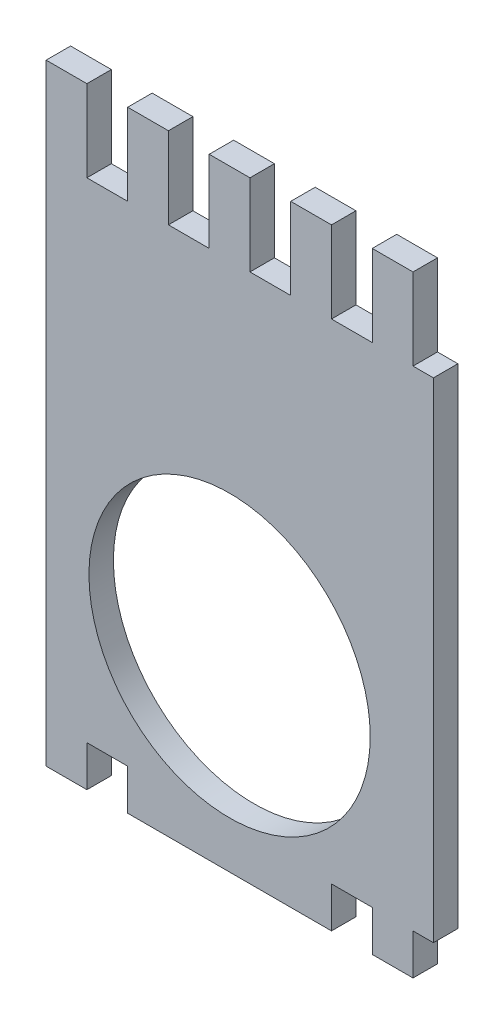
ISO-10303-21;
HEADER;
FILE_DESCRIPTION(('STEP AP214'),'2;1');
FILE_NAME('part.step','',(''),(''),'','','');
FILE_SCHEMA(('AUTOMOTIVE_DESIGN { 1 0 10303 214 1 1 1 1 }'));
ENDSEC;
DATA;
#1=APPLICATION_CONTEXT('core data for automotive mechanical design processes');
#2=APPLICATION_PROTOCOL_DEFINITION('international standard','automotive_design',2000,#1);
#3=PRODUCT_CONTEXT('',#1,'mechanical');
#4=PRODUCT('Part','Part','',(#3));
#5=PRODUCT_RELATED_PRODUCT_CATEGORY('part','',(#4));
#6=PRODUCT_DEFINITION_FORMATION('','',#4);
#7=PRODUCT_DEFINITION_CONTEXT('part definition',#1,'design');
#8=PRODUCT_DEFINITION('design','',#6,#7);
#9=PRODUCT_DEFINITION_SHAPE('','',#8);
#10=(LENGTH_UNIT() NAMED_UNIT(*) SI_UNIT(.MILLI.,.METRE.));
#11=(NAMED_UNIT(*) PLANE_ANGLE_UNIT() SI_UNIT($,.RADIAN.));
#12=(NAMED_UNIT(*) SI_UNIT($,.STERADIAN.) SOLID_ANGLE_UNIT());
#13=UNCERTAINTY_MEASURE_WITH_UNIT(LENGTH_MEASURE(1.E-05),#10,'distance_accuracy_value','');
#14=(GEOMETRIC_REPRESENTATION_CONTEXT(3) GLOBAL_UNCERTAINTY_ASSIGNED_CONTEXT((#13)) GLOBAL_UNIT_ASSIGNED_CONTEXT((#10,
#11,#12)) REPRESENTATION_CONTEXT('',''));
#15=CARTESIAN_POINT('',(0.,0.,0.));
#16=DIRECTION('',(0.,0.,1.));
#17=DIRECTION('',(1.,0.,0.));
#18=AXIS2_PLACEMENT_3D('',#15,#16,#17);
#19=CARTESIAN_POINT('',(-25.,-40.,3.));
#20=DIRECTION('',(0.,1.,0.));
#21=DIRECTION('',(0.,0.,1.));
#22=AXIS2_PLACEMENT_3D('',#19,#20,#21);
#23=PLANE('',#22);
#24=DIRECTION('',(1.,0.,0.));
#25=VECTOR('',#24,1.);
#26=CARTESIAN_POINT('',(-25.,-40.,0.));
#27=LINE('',#26,#25);
#28=CARTESIAN_POINT('',(12.5,-40.,0.));
#29=VERTEX_POINT('',#28);
#30=CARTESIAN_POINT('',(17.5,-40.,0.));
#31=VERTEX_POINT('',#30);
#32=EDGE_CURVE('E512',#29,#31,#27,.T.);
#33=ORIENTED_EDGE('',*,*,#32,.T.);
#34=DIRECTION('',(0.,0.,1.));
#35=VECTOR('',#34,1.);
#36=CARTESIAN_POINT('',(17.5,-40.,0.));
#37=LINE('',#36,#35);
#38=CARTESIAN_POINT('',(17.5,-40.,3.));
#39=VERTEX_POINT('',#38);
#40=EDGE_CURVE('E57',#31,#39,#37,.T.);
#41=ORIENTED_EDGE('',*,*,#40,.T.);
#42=DIRECTION('',(1.,0.,0.));
#43=VECTOR('',#42,1.);
#44=CARTESIAN_POINT('',(-25.,-40.,3.));
#45=LINE('',#44,#43);
#46=CARTESIAN_POINT('',(12.5,-40.,3.));
#47=VERTEX_POINT('',#46);
#48=EDGE_CURVE('E510',#47,#39,#45,.T.);
#49=ORIENTED_EDGE('',*,*,#48,.F.);
#50=DIRECTION('',(0.,0.,1.));
#51=VECTOR('',#50,1.);
#52=CARTESIAN_POINT('',(12.5,-40.,0.));
#53=LINE('',#52,#51);
#54=EDGE_CURVE('E313',#29,#47,#53,.T.);
#55=ORIENTED_EDGE('',*,*,#54,.F.);
#56=EDGE_LOOP('',(#33,#41,#49,#55));
#57=FACE_BOUND('',#56,.T.);
#58=ADVANCED_FACE('F33',(#57),#23,.F.);
#59=CARTESIAN_POINT('',(-25.,20.,3.));
#60=DIRECTION('',(0.,-1.,0.));
#61=DIRECTION('',(0.,0.,-1.));
#62=AXIS2_PLACEMENT_3D('',#59,#60,#61);
#63=PLANE('',#62);
#64=DIRECTION('',(-1.,0.,0.));
#65=VECTOR('',#64,1.);
#66=CARTESIAN_POINT('',(-25.,20.,3.));
#67=LINE('',#66,#65);
#68=CARTESIAN_POINT('',(17.5,20.,3.));
#69=VERTEX_POINT('',#68);
#70=CARTESIAN_POINT('',(12.5,20.,3.));
#71=VERTEX_POINT('',#70);
#72=EDGE_CURVE('E479',#69,#71,#67,.T.);
#73=ORIENTED_EDGE('',*,*,#72,.F.);
#74=DIRECTION('',(0.,0.,1.));
#75=VECTOR('',#74,1.);
#76=CARTESIAN_POINT('',(17.5,20.,0.));
#77=LINE('',#76,#75);
#78=CARTESIAN_POINT('',(17.5,20.,0.));
#79=VERTEX_POINT('',#78);
#80=EDGE_CURVE('E290',#79,#69,#77,.T.);
#81=ORIENTED_EDGE('',*,*,#80,.F.);
#82=DIRECTION('',(-1.,0.,0.));
#83=VECTOR('',#82,1.);
#84=CARTESIAN_POINT('',(-25.,20.,0.));
#85=LINE('',#84,#83);
#86=CARTESIAN_POINT('',(12.5,20.,0.));
#87=VERTEX_POINT('',#86);
#88=EDGE_CURVE('E458',#79,#87,#85,.T.);
#89=ORIENTED_EDGE('',*,*,#88,.T.);
#90=DIRECTION('',(0.,0.,1.));
#91=VECTOR('',#90,1.);
#92=CARTESIAN_POINT('',(12.5,20.,0.));
#93=LINE('',#92,#91);
#94=EDGE_CURVE('E342',#87,#71,#93,.T.);
#95=ORIENTED_EDGE('',*,*,#94,.T.);
#96=EDGE_LOOP('',(#73,#81,#89,#95));
#97=FACE_BOUND('',#96,.T.);
#98=ADVANCED_FACE('F524',(#97),#63,.F.);
#99=CARTESIAN_POINT('',(7.49999999999999,20.,3.));
#100=VERTEX_POINT('',#99);
#101=CARTESIAN_POINT('',(2.49999999999998,20.,3.));
#102=VERTEX_POINT('',#101);
#103=EDGE_CURVE('E471',#100,#102,#67,.T.);
#104=ORIENTED_EDGE('',*,*,#103,.F.);
#105=DIRECTION('',(0.,0.,1.));
#106=VECTOR('',#105,1.);
#107=CARTESIAN_POINT('',(7.49999999999999,20.,0.));
#108=LINE('',#107,#106);
#109=CARTESIAN_POINT('',(7.49999999999999,20.,0.));
#110=VERTEX_POINT('',#109);
#111=EDGE_CURVE('E329',#110,#100,#108,.T.);
#112=ORIENTED_EDGE('',*,*,#111,.F.);
#113=CARTESIAN_POINT('',(2.49999999999998,20.,0.));
#114=VERTEX_POINT('',#113);
#115=EDGE_CURVE('E469',#110,#114,#85,.T.);
#116=ORIENTED_EDGE('',*,*,#115,.T.);
#117=DIRECTION('',(0.,0.,1.));
#118=VECTOR('',#117,1.);
#119=CARTESIAN_POINT('',(2.49999999999998,20.,0.));
#120=LINE('',#119,#118);
#121=EDGE_CURVE('E370',#114,#102,#120,.T.);
#122=ORIENTED_EDGE('',*,*,#121,.T.);
#123=EDGE_LOOP('',(#104,#112,#116,#122));
#124=FACE_BOUND('',#123,.T.);
#125=ADVANCED_FACE('F537',(#124),#63,.F.);
#126=CARTESIAN_POINT('',(-2.50000000000001,20.,3.));
#127=VERTEX_POINT('',#126);
#128=CARTESIAN_POINT('',(-7.50000000000001,20.,3.));
#129=VERTEX_POINT('',#128);
#130=EDGE_CURVE('E470',#127,#129,#67,.T.);
#131=ORIENTED_EDGE('',*,*,#130,.F.);
#132=DIRECTION('',(0.,0.,1.));
#133=VECTOR('',#132,1.);
#134=CARTESIAN_POINT('',(-2.50000000000001,20.,0.));
#135=LINE('',#134,#133);
#136=CARTESIAN_POINT('',(-2.50000000000001,20.,0.));
#137=VERTEX_POINT('',#136);
#138=EDGE_CURVE('E357',#137,#127,#135,.T.);
#139=ORIENTED_EDGE('',*,*,#138,.F.);
#140=CARTESIAN_POINT('',(-7.50000000000001,20.,0.));
#141=VERTEX_POINT('',#140);
#142=EDGE_CURVE('E446',#137,#141,#85,.T.);
#143=ORIENTED_EDGE('',*,*,#142,.T.);
#144=DIRECTION('',(0.,0.,1.));
#145=VECTOR('',#144,1.);
#146=CARTESIAN_POINT('',(-7.50000000000002,20.,0.));
#147=LINE('',#146,#145);
#148=EDGE_CURVE('E412',#141,#129,#147,.T.);
#149=ORIENTED_EDGE('',*,*,#148,.T.);
#150=EDGE_LOOP('',(#131,#139,#143,#149));
#151=FACE_BOUND('',#150,.T.);
#152=ADVANCED_FACE('F556',(#151),#63,.F.);
#153=CARTESIAN_POINT('',(-17.5,-40.,0.));
#154=VERTEX_POINT('',#153);
#155=CARTESIAN_POINT('',(-12.5,-40.,0.));
#156=VERTEX_POINT('',#155);
#157=EDGE_CURVE('E513',#154,#156,#27,.T.);
#158=ORIENTED_EDGE('',*,*,#157,.T.);
#159=DIRECTION('',(0.,0.,1.));
#160=VECTOR('',#159,1.);
#161=CARTESIAN_POINT('',(-12.5,-40.,0.));
#162=LINE('',#161,#160);
#163=CARTESIAN_POINT('',(-12.5,-40.,3.));
#164=VERTEX_POINT('',#163);
#165=EDGE_CURVE('E385',#156,#164,#162,.T.);
#166=ORIENTED_EDGE('',*,*,#165,.T.);
#167=CARTESIAN_POINT('',(-17.5,-40.,3.));
#168=VERTEX_POINT('',#167);
#169=EDGE_CURVE('E433',#168,#164,#45,.T.);
#170=ORIENTED_EDGE('',*,*,#169,.F.);
#171=DIRECTION('',(0.,0.,1.));
#172=VECTOR('',#171,1.);
#173=CARTESIAN_POINT('',(-17.5,-40.,0.));
#174=LINE('',#173,#172);
#175=EDGE_CURVE('E429',#154,#168,#174,.T.);
#176=ORIENTED_EDGE('',*,*,#175,.F.);
#177=EDGE_LOOP('',(#158,#166,#170,#176));
#178=FACE_BOUND('',#177,.T.);
#179=ADVANCED_FACE('F634',(#178),#23,.F.);
#180=CARTESIAN_POINT('',(-12.5,20.,3.));
#181=VERTEX_POINT('',#180);
#182=CARTESIAN_POINT('',(-17.5,20.,3.));
#183=VERTEX_POINT('',#182);
#184=EDGE_CURVE('E448',#181,#183,#67,.T.);
#185=ORIENTED_EDGE('',*,*,#184,.F.);
#186=DIRECTION('',(0.,0.,1.));
#187=VECTOR('',#186,1.);
#188=CARTESIAN_POINT('',(-12.5,20.,0.));
#189=LINE('',#188,#187);
#190=CARTESIAN_POINT('',(-12.5,20.,0.));
#191=VERTEX_POINT('',#190);
#192=EDGE_CURVE('E399',#191,#181,#189,.T.);
#193=ORIENTED_EDGE('',*,*,#192,.F.);
#194=CARTESIAN_POINT('',(-17.5,20.,0.));
#195=VERTEX_POINT('',#194);
#196=EDGE_CURVE('E443',#191,#195,#85,.T.);
#197=ORIENTED_EDGE('',*,*,#196,.T.);
#198=DIRECTION('',(0.,0.,1.));
#199=VECTOR('',#198,1.);
#200=CARTESIAN_POINT('',(-17.5,20.,0.));
#201=LINE('',#200,#199);
#202=EDGE_CURVE('E491',#195,#183,#201,.T.);
#203=ORIENTED_EDGE('',*,*,#202,.T.);
#204=EDGE_LOOP('',(#185,#193,#197,#203));
#205=FACE_BOUND('',#204,.T.);
#206=ADVANCED_FACE('F570',(#205),#63,.F.);
#207=CARTESIAN_POINT('',(22.5,-40.,3.));
#208=VERTEX_POINT('',#207);
#209=CARTESIAN_POINT('',(25.,-40.,3.));
#210=VERTEX_POINT('',#209);
#211=EDGE_CURVE('E36',#208,#210,#45,.T.);
#212=ORIENTED_EDGE('',*,*,#211,.F.);
#213=DIRECTION('',(0.,0.,1.));
#214=VECTOR('',#213,1.);
#215=CARTESIAN_POINT('',(22.5,-40.,0.));
#216=LINE('',#215,#214);
#217=CARTESIAN_POINT('',(22.5,-40.,0.));
#218=VERTEX_POINT('',#217);
#219=EDGE_CURVE('E277',#218,#208,#216,.T.);
#220=ORIENTED_EDGE('',*,*,#219,.F.);
#221=CARTESIAN_POINT('',(25.,-40.,0.));
#222=VERTEX_POINT('',#221);
#223=EDGE_CURVE('E514',#218,#222,#27,.T.);
#224=ORIENTED_EDGE('',*,*,#223,.T.);
#225=DIRECTION('',(0.,0.,-1.));
#226=VECTOR('',#225,1.);
#227=CARTESIAN_POINT('',(25.,-40.,3.));
#228=LINE('',#227,#226);
#229=EDGE_CURVE('E11',#210,#222,#228,.T.);
#230=ORIENTED_EDGE('',*,*,#229,.F.);
#231=EDGE_LOOP('',(#212,#220,#224,#230));
#232=FACE_BOUND('',#231,.T.);
#233=ADVANCED_FACE('F635',(#232),#23,.F.);
#234=CARTESIAN_POINT('',(25.,20.,3.));
#235=DIRECTION('',(-1.,0.,0.));
#236=DIRECTION('',(0.,-1.,0.));
#237=AXIS2_PLACEMENT_3D('',#234,#235,#236);
#238=PLANE('',#237);
#239=DIRECTION('',(0.,1.,0.));
#240=VECTOR('',#239,1.);
#241=CARTESIAN_POINT('',(25.,20.,0.));
#242=LINE('',#241,#240);
#243=CARTESIAN_POINT('',(25.,20.,0.));
#244=VERTEX_POINT('',#243);
#245=EDGE_CURVE('E447',#222,#244,#242,.T.);
#246=ORIENTED_EDGE('',*,*,#245,.T.);
#247=DIRECTION('',(0.,0.,-1.));
#248=VECTOR('',#247,1.);
#249=CARTESIAN_POINT('',(25.,20.,3.));
#250=LINE('',#249,#248);
#251=CARTESIAN_POINT('',(25.,20.,3.));
#252=VERTEX_POINT('',#251);
#253=EDGE_CURVE('E42',#252,#244,#250,.T.);
#254=ORIENTED_EDGE('',*,*,#253,.F.);
#255=DIRECTION('',(0.,1.,0.));
#256=VECTOR('',#255,1.);
#257=CARTESIAN_POINT('',(25.,20.,3.));
#258=LINE('',#257,#256);
#259=EDGE_CURVE('E475',#210,#252,#258,.T.);
#260=ORIENTED_EDGE('',*,*,#259,.F.);
#261=ORIENTED_EDGE('',*,*,#229,.T.);
#262=EDGE_LOOP('',(#246,#254,#260,#261));
#263=FACE_BOUND('',#262,.T.);
#264=ADVANCED_FACE('F643',(#263),#238,.F.);
#265=CARTESIAN_POINT('',(22.5,20.,0.));
#266=VERTEX_POINT('',#265);
#267=EDGE_CURVE('E465',#244,#266,#85,.T.);
#268=ORIENTED_EDGE('',*,*,#267,.T.);
#269=DIRECTION('',(0.,0.,1.));
#270=VECTOR('',#269,1.);
#271=CARTESIAN_POINT('',(22.5,20.,0.));
#272=LINE('',#271,#270);
#273=CARTESIAN_POINT('',(22.5,20.,3.));
#274=VERTEX_POINT('',#273);
#275=EDGE_CURVE('E303',#266,#274,#272,.T.);
#276=ORIENTED_EDGE('',*,*,#275,.T.);
#277=EDGE_CURVE('E482',#252,#274,#67,.T.);
#278=ORIENTED_EDGE('',*,*,#277,.F.);
#279=ORIENTED_EDGE('',*,*,#253,.T.);
#280=EDGE_LOOP('',(#268,#276,#278,#279));
#281=FACE_BOUND('',#280,.T.);
#282=ADVANCED_FACE('F640',(#281),#63,.F.);
#283=CARTESIAN_POINT('',(0.,0.,3.));
#284=DIRECTION('',(0.,0.,1.));
#285=DIRECTION('',(1.,0.,0.));
#286=AXIS2_PLACEMENT_3D('',#283,#284,#285);
#287=PLANE('',#286);
#288=DIRECTION('',(0.,-1.,0.));
#289=VECTOR('',#288,1.);
#290=CARTESIAN_POINT('',(-22.5,30.,3.));
#291=LINE('',#290,#289);
#292=CARTESIAN_POINT('',(-22.5,30.,3.));
#293=VERTEX_POINT('',#292);
#294=CARTESIAN_POINT('',(-22.5,-45.,3.));
#295=VERTEX_POINT('',#294);
#296=EDGE_CURVE('E432',#293,#295,#291,.T.);
#297=ORIENTED_EDGE('',*,*,#296,.T.);
#298=DIRECTION('',(1.,0.,0.));
#299=VECTOR('',#298,1.);
#300=CARTESIAN_POINT('',(-22.5,-45.,3.));
#301=LINE('',#300,#299);
#302=CARTESIAN_POINT('',(-17.5,-45.,3.));
#303=VERTEX_POINT('',#302);
#304=EDGE_CURVE('E409',#295,#303,#301,.T.);
#305=ORIENTED_EDGE('',*,*,#304,.T.);
#306=DIRECTION('',(0.,1.,0.));
#307=VECTOR('',#306,1.);
#308=CARTESIAN_POINT('',(-17.5,-40.,3.));
#309=LINE('',#308,#307);
#310=EDGE_CURVE('E421',#303,#168,#309,.T.);
#311=ORIENTED_EDGE('',*,*,#310,.T.);
#312=ORIENTED_EDGE('',*,*,#169,.T.);
#313=DIRECTION('',(0.,-1.,0.));
#314=VECTOR('',#313,1.);
#315=CARTESIAN_POINT('',(-12.5,-40.,3.));
#316=LINE('',#315,#314);
#317=CARTESIAN_POINT('',(-12.5,-45.,3.));
#318=VERTEX_POINT('',#317);
#319=EDGE_CURVE('E367',#164,#318,#316,.T.);
#320=ORIENTED_EDGE('',*,*,#319,.T.);
#321=DIRECTION('',(1.,0.,0.));
#322=VECTOR('',#321,1.);
#323=CARTESIAN_POINT('',(-12.5,-45.,3.));
#324=LINE('',#323,#322);
#325=CARTESIAN_POINT('',(12.5,-45.,3.));
#326=VERTEX_POINT('',#325);
#327=EDGE_CURVE('E379',#318,#326,#324,.T.);
#328=ORIENTED_EDGE('',*,*,#327,.T.);
#329=DIRECTION('',(0.,1.,0.));
#330=VECTOR('',#329,1.);
#331=CARTESIAN_POINT('',(12.5,-40.,3.));
#332=LINE('',#331,#330);
#333=EDGE_CURVE('E300',#326,#47,#332,.T.);
#334=ORIENTED_EDGE('',*,*,#333,.T.);
#335=ORIENTED_EDGE('',*,*,#48,.T.);
#336=DIRECTION('',(0.,-1.,0.));
#337=VECTOR('',#336,1.);
#338=CARTESIAN_POINT('',(17.5,-40.,3.));
#339=LINE('',#338,#337);
#340=CARTESIAN_POINT('',(17.5,-45.,3.));
#341=VERTEX_POINT('',#340);
#342=EDGE_CURVE('E272',#39,#341,#339,.T.);
#343=ORIENTED_EDGE('',*,*,#342,.T.);
#344=DIRECTION('',(1.,0.,0.));
#345=VECTOR('',#344,1.);
#346=CARTESIAN_POINT('',(17.5,-45.,3.));
#347=LINE('',#346,#345);
#348=CARTESIAN_POINT('',(22.5,-45.,3.));
#349=VERTEX_POINT('',#348);
#350=EDGE_CURVE('E249',#341,#349,#347,.T.);
#351=ORIENTED_EDGE('',*,*,#350,.T.);
#352=DIRECTION('',(0.,1.,0.));
#353=VECTOR('',#352,1.);
#354=CARTESIAN_POINT('',(22.5,-40.,3.));
#355=LINE('',#354,#353);
#356=EDGE_CURVE('E266',#349,#208,#355,.T.);
#357=ORIENTED_EDGE('',*,*,#356,.T.);
#358=ORIENTED_EDGE('',*,*,#211,.T.);
#359=ORIENTED_EDGE('',*,*,#259,.T.);
#360=ORIENTED_EDGE('',*,*,#277,.T.);
#361=DIRECTION('',(0.,1.,0.));
#362=VECTOR('',#361,1.);
#363=CARTESIAN_POINT('',(22.5,30.,3.));
#364=LINE('',#363,#362);
#365=CARTESIAN_POINT('',(22.5,30.,3.));
#366=VERTEX_POINT('',#365);
#367=EDGE_CURVE('E293',#274,#366,#364,.T.);
#368=ORIENTED_EDGE('',*,*,#367,.T.);
#369=DIRECTION('',(-1.,0.,0.));
#370=VECTOR('',#369,1.);
#371=CARTESIAN_POINT('',(17.5,30.,3.));
#372=LINE('',#371,#370);
#373=CARTESIAN_POINT('',(17.5,30.,3.));
#374=VERTEX_POINT('',#373);
#375=EDGE_CURVE('E284',#366,#374,#372,.T.);
#376=ORIENTED_EDGE('',*,*,#375,.T.);
#377=DIRECTION('',(0.,-1.,0.));
#378=VECTOR('',#377,1.);
#379=CARTESIAN_POINT('',(17.5,30.,3.));
#380=LINE('',#379,#378);
#381=EDGE_CURVE('E276',#374,#69,#380,.T.);
#382=ORIENTED_EDGE('',*,*,#381,.T.);
#383=ORIENTED_EDGE('',*,*,#72,.T.);
#384=DIRECTION('',(0.,1.,0.));
#385=VECTOR('',#384,1.);
#386=CARTESIAN_POINT('',(12.5,30.,3.));
#387=LINE('',#386,#385);
#388=CARTESIAN_POINT('',(12.5,30.,3.));
#389=VERTEX_POINT('',#388);
#390=EDGE_CURVE('E332',#71,#389,#387,.T.);
#391=ORIENTED_EDGE('',*,*,#390,.T.);
#392=DIRECTION('',(-1.,0.,0.));
#393=VECTOR('',#392,1.);
#394=CARTESIAN_POINT('',(7.49999999999999,30.,3.));
#395=LINE('',#394,#393);
#396=CARTESIAN_POINT('',(7.49999999999999,30.,3.));
#397=VERTEX_POINT('',#396);
#398=EDGE_CURVE('E323',#389,#397,#395,.T.);
#399=ORIENTED_EDGE('',*,*,#398,.T.);
#400=DIRECTION('',(0.,-1.,0.));
#401=VECTOR('',#400,1.);
#402=CARTESIAN_POINT('',(7.49999999999999,30.,3.));
#403=LINE('',#402,#401);
#404=EDGE_CURVE('E316',#397,#100,#403,.T.);
#405=ORIENTED_EDGE('',*,*,#404,.T.);
#406=ORIENTED_EDGE('',*,*,#103,.T.);
#407=DIRECTION('',(0.,1.,0.));
#408=VECTOR('',#407,1.);
#409=CARTESIAN_POINT('',(2.49999999999999,30.,3.));
#410=LINE('',#409,#408);
#411=CARTESIAN_POINT('',(2.49999999999999,30.,3.));
#412=VERTEX_POINT('',#411);
#413=EDGE_CURVE('E360',#102,#412,#410,.T.);
#414=ORIENTED_EDGE('',*,*,#413,.T.);
#415=DIRECTION('',(-1.,0.,0.));
#416=VECTOR('',#415,1.);
#417=CARTESIAN_POINT('',(-2.50000000000001,30.,3.));
#418=LINE('',#417,#416);
#419=CARTESIAN_POINT('',(-2.50000000000001,30.,3.));
#420=VERTEX_POINT('',#419);
#421=EDGE_CURVE('E351',#412,#420,#418,.T.);
#422=ORIENTED_EDGE('',*,*,#421,.T.);
#423=DIRECTION('',(0.,-1.,0.));
#424=VECTOR('',#423,1.);
#425=CARTESIAN_POINT('',(-2.50000000000001,30.,3.));
#426=LINE('',#425,#424);
#427=EDGE_CURVE('E339',#420,#127,#426,.T.);
#428=ORIENTED_EDGE('',*,*,#427,.T.);
#429=ORIENTED_EDGE('',*,*,#130,.T.);
#430=DIRECTION('',(0.,1.,0.));
#431=VECTOR('',#430,1.);
#432=CARTESIAN_POINT('',(-7.50000000000001,30.,3.));
#433=LINE('',#432,#431);
#434=CARTESIAN_POINT('',(-7.50000000000001,30.,3.));
#435=VERTEX_POINT('',#434);
#436=EDGE_CURVE('E402',#129,#435,#433,.T.);
#437=ORIENTED_EDGE('',*,*,#436,.T.);
#438=DIRECTION('',(-1.,0.,0.));
#439=VECTOR('',#438,1.);
#440=CARTESIAN_POINT('',(-12.5,30.,3.));
#441=LINE('',#440,#439);
#442=CARTESIAN_POINT('',(-12.5,30.,3.));
#443=VERTEX_POINT('',#442);
#444=EDGE_CURVE('E393',#435,#443,#441,.T.);
#445=ORIENTED_EDGE('',*,*,#444,.T.);
#446=DIRECTION('',(0.,-1.,0.));
#447=VECTOR('',#446,1.);
#448=CARTESIAN_POINT('',(-12.5,30.,3.));
#449=LINE('',#448,#447);
#450=EDGE_CURVE('E387',#443,#181,#449,.T.);
#451=ORIENTED_EDGE('',*,*,#450,.T.);
#452=ORIENTED_EDGE('',*,*,#184,.T.);
#453=DIRECTION('',(0.,1.,0.));
#454=VECTOR('',#453,1.);
#455=CARTESIAN_POINT('',(-17.5,30.,3.));
#456=LINE('',#455,#454);
#457=CARTESIAN_POINT('',(-17.5,30.,3.));
#458=VERTEX_POINT('',#457);
#459=EDGE_CURVE('E485',#183,#458,#456,.T.);
#460=ORIENTED_EDGE('',*,*,#459,.T.);
#461=DIRECTION('',(-1.,0.,0.));
#462=VECTOR('',#461,1.);
#463=CARTESIAN_POINT('',(-22.5,30.,3.));
#464=LINE('',#463,#462);
#465=EDGE_CURVE('E488',#458,#293,#464,.T.);
#466=ORIENTED_EDGE('',*,*,#465,.T.);
#467=EDGE_LOOP('',(#297,#305,#311,#312,#320,#328,#334,#335,#343,#351,#357,#358,#359,#360,#368,
#376,#382,#383,#391,#399,#405,#406,#414,#422,#428,#429,#437,#445,#451,#452,#460,#466));
#468=FACE_BOUND('',#467,.T.);
#469=CARTESIAN_POINT('',(0.,-22.,3.));
#470=DIRECTION('',(0.,0.,1.));
#471=DIRECTION('',(1.,0.,0.));
#472=AXIS2_PLACEMENT_3D('',#469,#470,#471);
#473=CIRCLE('',#472,17.25);
#474=CARTESIAN_POINT('',(17.25,-22.,3.));
#475=VERTEX_POINT('',#474);
#476=EDGE_CURVE('E503',#475,#475,#473,.T.);
#477=ORIENTED_EDGE('',*,*,#476,.F.);
#478=EDGE_LOOP('',(#477));
#479=FACE_BOUND('',#478,.T.);
#480=ADVANCED_FACE('F516',(#468,#479),#287,.T.);
#481=CARTESIAN_POINT('',(0.,0.,0.));
#482=DIRECTION('',(0.,0.,1.));
#483=DIRECTION('',(1.,0.,0.));
#484=AXIS2_PLACEMENT_3D('',#481,#482,#483);
#485=PLANE('',#484);
#486=CARTESIAN_POINT('',(0.,-22.,0.));
#487=DIRECTION('',(0.,0.,1.));
#488=DIRECTION('',(1.,0.,0.));
#489=AXIS2_PLACEMENT_3D('',#486,#487,#488);
#490=CIRCLE('',#489,17.25);
#491=CARTESIAN_POINT('',(17.25,-22.,0.));
#492=VERTEX_POINT('',#491);
#493=EDGE_CURVE('E505',#492,#492,#490,.T.);
#494=ORIENTED_EDGE('',*,*,#493,.T.);
#495=EDGE_LOOP('',(#494));
#496=FACE_BOUND('',#495,.T.);
#497=DIRECTION('',(1.,0.,0.));
#498=VECTOR('',#497,1.);
#499=CARTESIAN_POINT('',(-22.5,-45.,0.));
#500=LINE('',#499,#498);
#501=CARTESIAN_POINT('',(-22.5,-45.,0.));
#502=VERTEX_POINT('',#501);
#503=CARTESIAN_POINT('',(-17.5,-45.,0.));
#504=VERTEX_POINT('',#503);
#505=EDGE_CURVE('E417',#502,#504,#500,.T.);
#506=ORIENTED_EDGE('',*,*,#505,.F.);
#507=DIRECTION('',(0.,-1.,0.));
#508=VECTOR('',#507,1.);
#509=CARTESIAN_POINT('',(-22.5,30.,0.));
#510=LINE('',#509,#508);
#511=CARTESIAN_POINT('',(-22.5,30.,0.));
#512=VERTEX_POINT('',#511);
#513=EDGE_CURVE('E602',#512,#502,#510,.T.);
#514=ORIENTED_EDGE('',*,*,#513,.F.);
#515=DIRECTION('',(-1.,0.,0.));
#516=VECTOR('',#515,1.);
#517=CARTESIAN_POINT('',(-22.5,30.,0.));
#518=LINE('',#517,#516);
#519=CARTESIAN_POINT('',(-17.5,30.,0.));
#520=VERTEX_POINT('',#519);
#521=EDGE_CURVE('E496',#520,#512,#518,.T.);
#522=ORIENTED_EDGE('',*,*,#521,.F.);
#523=DIRECTION('',(0.,1.,0.));
#524=VECTOR('',#523,1.);
#525=CARTESIAN_POINT('',(-17.5,30.,0.));
#526=LINE('',#525,#524);
#527=EDGE_CURVE('E497',#195,#520,#526,.T.);
#528=ORIENTED_EDGE('',*,*,#527,.F.);
#529=ORIENTED_EDGE('',*,*,#196,.F.);
#530=DIRECTION('',(0.,-1.,0.));
#531=VECTOR('',#530,1.);
#532=CARTESIAN_POINT('',(-12.5,30.,0.));
#533=LINE('',#532,#531);
#534=CARTESIAN_POINT('',(-12.5,30.,0.));
#535=VERTEX_POINT('',#534);
#536=EDGE_CURVE('E389',#535,#191,#533,.T.);
#537=ORIENTED_EDGE('',*,*,#536,.F.);
#538=DIRECTION('',(-1.,0.,0.));
#539=VECTOR('',#538,1.);
#540=CARTESIAN_POINT('',(-12.5,30.,0.));
#541=LINE('',#540,#539);
#542=CARTESIAN_POINT('',(-7.50000000000001,30.,0.));
#543=VERTEX_POINT('',#542);
#544=EDGE_CURVE('E396',#543,#535,#541,.T.);
#545=ORIENTED_EDGE('',*,*,#544,.F.);
#546=DIRECTION('',(0.,1.,0.));
#547=VECTOR('',#546,1.);
#548=CARTESIAN_POINT('',(-7.50000000000001,30.,0.));
#549=LINE('',#548,#547);
#550=EDGE_CURVE('E392',#141,#543,#549,.T.);
#551=ORIENTED_EDGE('',*,*,#550,.F.);
#552=ORIENTED_EDGE('',*,*,#142,.F.);
#553=DIRECTION('',(0.,-1.,0.));
#554=VECTOR('',#553,1.);
#555=CARTESIAN_POINT('',(-2.50000000000001,30.,0.));
#556=LINE('',#555,#554);
#557=CARTESIAN_POINT('',(-2.50000000000001,30.,0.));
#558=VERTEX_POINT('',#557);
#559=EDGE_CURVE('E347',#558,#137,#556,.T.);
#560=ORIENTED_EDGE('',*,*,#559,.F.);
#561=DIRECTION('',(-1.,0.,0.));
#562=VECTOR('',#561,1.);
#563=CARTESIAN_POINT('',(-2.50000000000001,30.,0.));
#564=LINE('',#563,#562);
#565=CARTESIAN_POINT('',(2.49999999999999,30.,0.));
#566=VERTEX_POINT('',#565);
#567=EDGE_CURVE('E354',#566,#558,#564,.T.);
#568=ORIENTED_EDGE('',*,*,#567,.F.);
#569=DIRECTION('',(0.,1.,0.));
#570=VECTOR('',#569,1.);
#571=CARTESIAN_POINT('',(2.49999999999999,30.,0.));
#572=LINE('',#571,#570);
#573=EDGE_CURVE('E350',#114,#566,#572,.T.);
#574=ORIENTED_EDGE('',*,*,#573,.F.);
#575=ORIENTED_EDGE('',*,*,#115,.F.);
#576=DIRECTION('',(0.,-1.,0.));
#577=VECTOR('',#576,1.);
#578=CARTESIAN_POINT('',(7.49999999999999,30.,0.));
#579=LINE('',#578,#577);
#580=CARTESIAN_POINT('',(7.49999999999999,30.,0.));
#581=VERTEX_POINT('',#580);
#582=EDGE_CURVE('E319',#581,#110,#579,.T.);
#583=ORIENTED_EDGE('',*,*,#582,.F.);
#584=DIRECTION('',(-1.,0.,0.));
#585=VECTOR('',#584,1.);
#586=CARTESIAN_POINT('',(7.49999999999999,30.,0.));
#587=LINE('',#586,#585);
#588=CARTESIAN_POINT('',(12.5,30.,0.));
#589=VERTEX_POINT('',#588);
#590=EDGE_CURVE('E326',#589,#581,#587,.T.);
#591=ORIENTED_EDGE('',*,*,#590,.F.);
#592=DIRECTION('',(0.,1.,0.));
#593=VECTOR('',#592,1.);
#594=CARTESIAN_POINT('',(12.5,30.,0.));
#595=LINE('',#594,#593);
#596=EDGE_CURVE('E322',#87,#589,#595,.T.);
#597=ORIENTED_EDGE('',*,*,#596,.F.);
#598=ORIENTED_EDGE('',*,*,#88,.F.);
#599=DIRECTION('',(0.,-1.,0.));
#600=VECTOR('',#599,1.);
#601=CARTESIAN_POINT('',(17.5,30.,0.));
#602=LINE('',#601,#600);
#603=CARTESIAN_POINT('',(17.5,30.,0.));
#604=VERTEX_POINT('',#603);
#605=EDGE_CURVE('E280',#604,#79,#602,.T.);
#606=ORIENTED_EDGE('',*,*,#605,.F.);
#607=DIRECTION('',(-1.,0.,0.));
#608=VECTOR('',#607,1.);
#609=CARTESIAN_POINT('',(17.5,30.,0.));
#610=LINE('',#609,#608);
#611=CARTESIAN_POINT('',(22.5,30.,0.));
#612=VERTEX_POINT('',#611);
#613=EDGE_CURVE('E287',#612,#604,#610,.T.);
#614=ORIENTED_EDGE('',*,*,#613,.F.);
#615=DIRECTION('',(0.,1.,0.));
#616=VECTOR('',#615,1.);
#617=CARTESIAN_POINT('',(22.5,30.,0.));
#618=LINE('',#617,#616);
#619=EDGE_CURVE('E283',#266,#612,#618,.T.);
#620=ORIENTED_EDGE('',*,*,#619,.F.);
#621=ORIENTED_EDGE('',*,*,#267,.F.);
#622=ORIENTED_EDGE('',*,*,#245,.F.);
#623=ORIENTED_EDGE('',*,*,#223,.F.);
#624=DIRECTION('',(0.,1.,0.));
#625=VECTOR('',#624,1.);
#626=CARTESIAN_POINT('',(22.5,-40.,0.));
#627=LINE('',#626,#625);
#628=CARTESIAN_POINT('',(22.5,-45.,0.));
#629=VERTEX_POINT('',#628);
#630=EDGE_CURVE('E255',#629,#218,#627,.T.);
#631=ORIENTED_EDGE('',*,*,#630,.F.);
#632=DIRECTION('',(1.,0.,0.));
#633=VECTOR('',#632,1.);
#634=CARTESIAN_POINT('',(17.5,-45.,0.));
#635=LINE('',#634,#633);
#636=CARTESIAN_POINT('',(17.5,-45.,0.));
#637=VERTEX_POINT('',#636);
#638=EDGE_CURVE('E247',#637,#629,#635,.T.);
#639=ORIENTED_EDGE('',*,*,#638,.F.);
#640=DIRECTION('',(0.,-1.,0.));
#641=VECTOR('',#640,1.);
#642=CARTESIAN_POINT('',(17.5,-40.,0.));
#643=LINE('',#642,#641);
#644=EDGE_CURVE('E262',#31,#637,#643,.T.);
#645=ORIENTED_EDGE('',*,*,#644,.F.);
#646=ORIENTED_EDGE('',*,*,#32,.F.);
#647=DIRECTION('',(0.,1.,0.));
#648=VECTOR('',#647,1.);
#649=CARTESIAN_POINT('',(12.5,-40.,0.));
#650=LINE('',#649,#648);
#651=CARTESIAN_POINT('',(12.5,-45.,0.));
#652=VERTEX_POINT('',#651);
#653=EDGE_CURVE('E307',#652,#29,#650,.T.);
#654=ORIENTED_EDGE('',*,*,#653,.F.);
#655=DIRECTION('',(1.,0.,0.));
#656=VECTOR('',#655,1.);
#657=CARTESIAN_POINT('',(-12.5,-45.,0.));
#658=LINE('',#657,#656);
#659=CARTESIAN_POINT('',(-12.5,-45.,0.));
#660=VERTEX_POINT('',#659);
#661=EDGE_CURVE('E378',#660,#652,#658,.T.);
#662=ORIENTED_EDGE('',*,*,#661,.F.);
#663=DIRECTION('',(0.,-1.,0.));
#664=VECTOR('',#663,1.);
#665=CARTESIAN_POINT('',(-12.5,-40.,0.));
#666=LINE('',#665,#664);
#667=EDGE_CURVE('E375',#156,#660,#666,.T.);
#668=ORIENTED_EDGE('',*,*,#667,.F.);
#669=ORIENTED_EDGE('',*,*,#157,.F.);
#670=DIRECTION('',(0.,1.,0.));
#671=VECTOR('',#670,1.);
#672=CARTESIAN_POINT('',(-17.5,-40.,0.));
#673=LINE('',#672,#671);
#674=EDGE_CURVE('E420',#504,#154,#673,.T.);
#675=ORIENTED_EDGE('',*,*,#674,.F.);
#676=EDGE_LOOP('',(#506,#514,#522,#528,#529,#537,#545,#551,#552,#560,#568,#574,#575,#583,#591,
#597,#598,#606,#614,#620,#621,#622,#623,#631,#639,#645,#646,#654,#662,#668,#669,#675));
#677=FACE_BOUND('',#676,.T.);
#678=ADVANCED_FACE('F261',(#496,#677),#485,.F.);
#679=CARTESIAN_POINT('',(0.,-22.,-2.));
#680=DIRECTION('',(0.,0.,1.));
#681=DIRECTION('',(1.,0.,0.));
#682=AXIS2_PLACEMENT_3D('',#679,#680,#681);
#683=CYLINDRICAL_SURFACE('',#682,17.25);
#684=ORIENTED_EDGE('',*,*,#476,.T.);
#685=EDGE_LOOP('',(#684));
#686=FACE_BOUND('',#685,.T.);
#687=ORIENTED_EDGE('',*,*,#493,.F.);
#688=EDGE_LOOP('',(#687));
#689=FACE_BOUND('',#688,.T.);
#690=ADVANCED_FACE('F630',(#686,#689),#683,.F.);
#691=CARTESIAN_POINT('',(-22.5,30.,0.));
#692=DIRECTION('',(-1.,0.,0.));
#693=DIRECTION('',(0.,-1.,0.));
#694=AXIS2_PLACEMENT_3D('',#691,#692,#693);
#695=PLANE('',#694);
#696=ORIENTED_EDGE('',*,*,#296,.F.);
#697=DIRECTION('',(0.,0.,1.));
#698=VECTOR('',#697,1.);
#699=CARTESIAN_POINT('',(-22.5,30.,0.));
#700=LINE('',#699,#698);
#701=EDGE_CURVE('E506',#512,#293,#700,.T.);
#702=ORIENTED_EDGE('',*,*,#701,.F.);
#703=ORIENTED_EDGE('',*,*,#513,.T.);
#704=DIRECTION('',(0.,0.,1.));
#705=VECTOR('',#704,1.);
#706=CARTESIAN_POINT('',(-22.5,-45.,0.));
#707=LINE('',#706,#705);
#708=EDGE_CURVE('E436',#502,#295,#707,.T.);
#709=ORIENTED_EDGE('',*,*,#708,.T.);
#710=EDGE_LOOP('',(#696,#702,#703,#709));
#711=FACE_BOUND('',#710,.T.);
#712=ADVANCED_FACE('F622',(#711),#695,.T.);
#713=CARTESIAN_POINT('',(-22.5,30.,0.));
#714=DIRECTION('',(0.,1.,0.));
#715=DIRECTION('',(0.,0.,1.));
#716=AXIS2_PLACEMENT_3D('',#713,#714,#715);
#717=PLANE('',#716);
#718=ORIENTED_EDGE('',*,*,#465,.F.);
#719=DIRECTION('',(0.,0.,1.));
#720=VECTOR('',#719,1.);
#721=CARTESIAN_POINT('',(-17.5,30.,0.));
#722=LINE('',#721,#720);
#723=EDGE_CURVE('E495',#520,#458,#722,.T.);
#724=ORIENTED_EDGE('',*,*,#723,.F.);
#725=ORIENTED_EDGE('',*,*,#521,.T.);
#726=ORIENTED_EDGE('',*,*,#701,.T.);
#727=EDGE_LOOP('',(#718,#724,#725,#726));
#728=FACE_BOUND('',#727,.T.);
#729=ADVANCED_FACE('F620',(#728),#717,.T.);
#730=CARTESIAN_POINT('',(-17.5,30.,0.));
#731=DIRECTION('',(1.,0.,0.));
#732=DIRECTION('',(0.,1.,0.));
#733=AXIS2_PLACEMENT_3D('',#730,#731,#732);
#734=PLANE('',#733);
#735=ORIENTED_EDGE('',*,*,#459,.F.);
#736=ORIENTED_EDGE('',*,*,#202,.F.);
#737=ORIENTED_EDGE('',*,*,#527,.T.);
#738=ORIENTED_EDGE('',*,*,#723,.T.);
#739=EDGE_LOOP('',(#735,#736,#737,#738));
#740=FACE_BOUND('',#739,.T.);
#741=ADVANCED_FACE('F617',(#740),#734,.T.);
#742=CARTESIAN_POINT('',(-17.5,-40.,0.));
#743=DIRECTION('',(1.,0.,0.));
#744=DIRECTION('',(0.,1.,0.));
#745=AXIS2_PLACEMENT_3D('',#742,#743,#744);
#746=PLANE('',#745);
#747=ORIENTED_EDGE('',*,*,#310,.F.);
#748=DIRECTION('',(0.,0.,1.));
#749=VECTOR('',#748,1.);
#750=CARTESIAN_POINT('',(-17.5,-45.,0.));
#751=LINE('',#750,#749);
#752=EDGE_CURVE('E426',#504,#303,#751,.T.);
#753=ORIENTED_EDGE('',*,*,#752,.F.);
#754=ORIENTED_EDGE('',*,*,#674,.T.);
#755=ORIENTED_EDGE('',*,*,#175,.T.);
#756=EDGE_LOOP('',(#747,#753,#754,#755));
#757=FACE_BOUND('',#756,.T.);
#758=ADVANCED_FACE('F628',(#757),#746,.T.);
#759=CARTESIAN_POINT('',(-22.5,-45.,0.));
#760=DIRECTION('',(0.,-1.,0.));
#761=DIRECTION('',(1.,0.,0.));
#762=AXIS2_PLACEMENT_3D('',#759,#760,#761);
#763=PLANE('',#762);
#764=ORIENTED_EDGE('',*,*,#304,.F.);
#765=ORIENTED_EDGE('',*,*,#708,.F.);
#766=ORIENTED_EDGE('',*,*,#505,.T.);
#767=ORIENTED_EDGE('',*,*,#752,.T.);
#768=EDGE_LOOP('',(#764,#765,#766,#767));
#769=FACE_BOUND('',#768,.T.);
#770=ADVANCED_FACE('F674',(#769),#763,.T.);
#771=CARTESIAN_POINT('',(-12.5,30.,0.));
#772=DIRECTION('',(-1.,0.,0.));
#773=DIRECTION('',(0.,-1.,0.));
#774=AXIS2_PLACEMENT_3D('',#771,#772,#773);
#775=PLANE('',#774);
#776=ORIENTED_EDGE('',*,*,#450,.F.);
#777=DIRECTION('',(0.,0.,1.));
#778=VECTOR('',#777,1.);
#779=CARTESIAN_POINT('',(-12.5,30.,0.));
#780=LINE('',#779,#778);
#781=EDGE_CURVE('E407',#535,#443,#780,.T.);
#782=ORIENTED_EDGE('',*,*,#781,.F.);
#783=ORIENTED_EDGE('',*,*,#536,.T.);
#784=ORIENTED_EDGE('',*,*,#192,.T.);
#785=EDGE_LOOP('',(#776,#782,#783,#784));
#786=FACE_BOUND('',#785,.T.);
#787=ADVANCED_FACE('F566',(#786),#775,.T.);
#788=CARTESIAN_POINT('',(-12.5,30.,0.));
#789=DIRECTION('',(0.,1.,0.));
#790=DIRECTION('',(0.,0.,1.));
#791=AXIS2_PLACEMENT_3D('',#788,#789,#790);
#792=PLANE('',#791);
#793=ORIENTED_EDGE('',*,*,#444,.F.);
#794=DIRECTION('',(0.,0.,1.));
#795=VECTOR('',#794,1.);
#796=CARTESIAN_POINT('',(-7.50000000000001,30.,0.));
#797=LINE('',#796,#795);
#798=EDGE_CURVE('E410',#543,#435,#797,.T.);
#799=ORIENTED_EDGE('',*,*,#798,.F.);
#800=ORIENTED_EDGE('',*,*,#544,.T.);
#801=ORIENTED_EDGE('',*,*,#781,.T.);
#802=EDGE_LOOP('',(#793,#799,#800,#801));
#803=FACE_BOUND('',#802,.T.);
#804=ADVANCED_FACE('F562',(#803),#792,.T.);
#805=CARTESIAN_POINT('',(-7.50000000000001,30.,0.));
#806=DIRECTION('',(1.,0.,0.));
#807=DIRECTION('',(0.,1.,0.));
#808=AXIS2_PLACEMENT_3D('',#805,#806,#807);
#809=PLANE('',#808);
#810=ORIENTED_EDGE('',*,*,#436,.F.);
#811=ORIENTED_EDGE('',*,*,#148,.F.);
#812=ORIENTED_EDGE('',*,*,#550,.T.);
#813=ORIENTED_EDGE('',*,*,#798,.T.);
#814=EDGE_LOOP('',(#810,#811,#812,#813));
#815=FACE_BOUND('',#814,.T.);
#816=ADVANCED_FACE('F559',(#815),#809,.T.);
#817=CARTESIAN_POINT('',(-12.5,-40.,0.));
#818=DIRECTION('',(-1.,0.,0.));
#819=DIRECTION('',(0.,0.,1.));
#820=AXIS2_PLACEMENT_3D('',#817,#818,#819);
#821=PLANE('',#820);
#822=ORIENTED_EDGE('',*,*,#319,.F.);
#823=ORIENTED_EDGE('',*,*,#165,.F.);
#824=ORIENTED_EDGE('',*,*,#667,.T.);
#825=DIRECTION('',(0.,0.,1.));
#826=VECTOR('',#825,1.);
#827=CARTESIAN_POINT('',(-12.5,-45.,0.));
#828=LINE('',#827,#826);
#829=EDGE_CURVE('E381',#660,#318,#828,.T.);
#830=ORIENTED_EDGE('',*,*,#829,.T.);
#831=EDGE_LOOP('',(#822,#823,#824,#830));
#832=FACE_BOUND('',#831,.T.);
#833=ADVANCED_FACE('F582',(#832),#821,.T.);
#834=CARTESIAN_POINT('',(-12.5,-45.,0.));
#835=DIRECTION('',(0.,-1.,0.));
#836=DIRECTION('',(1.,0.,0.));
#837=AXIS2_PLACEMENT_3D('',#834,#835,#836);
#838=PLANE('',#837);
#839=ORIENTED_EDGE('',*,*,#327,.F.);
#840=ORIENTED_EDGE('',*,*,#829,.F.);
#841=ORIENTED_EDGE('',*,*,#661,.T.);
#842=DIRECTION('',(0.,0.,1.));
#843=VECTOR('',#842,1.);
#844=CARTESIAN_POINT('',(12.5,-45.,0.));
#845=LINE('',#844,#843);
#846=EDGE_CURVE('E310',#652,#326,#845,.T.);
#847=ORIENTED_EDGE('',*,*,#846,.T.);
#848=EDGE_LOOP('',(#839,#840,#841,#847));
#849=FACE_BOUND('',#848,.T.);
#850=ADVANCED_FACE('F587',(#849),#838,.T.);
#851=CARTESIAN_POINT('',(-2.50000000000001,30.,0.));
#852=DIRECTION('',(-1.,0.,0.));
#853=DIRECTION('',(0.,-1.,0.));
#854=AXIS2_PLACEMENT_3D('',#851,#852,#853);
#855=PLANE('',#854);
#856=ORIENTED_EDGE('',*,*,#427,.F.);
#857=DIRECTION('',(0.,0.,1.));
#858=VECTOR('',#857,1.);
#859=CARTESIAN_POINT('',(-2.50000000000001,30.,0.));
#860=LINE('',#859,#858);
#861=EDGE_CURVE('E365',#558,#420,#860,.T.);
#862=ORIENTED_EDGE('',*,*,#861,.F.);
#863=ORIENTED_EDGE('',*,*,#559,.T.);
#864=ORIENTED_EDGE('',*,*,#138,.T.);
#865=EDGE_LOOP('',(#856,#862,#863,#864));
#866=FACE_BOUND('',#865,.T.);
#867=ADVANCED_FACE('F550',(#866),#855,.T.);
#868=CARTESIAN_POINT('',(-2.50000000000001,30.,0.));
#869=DIRECTION('',(0.,1.,0.));
#870=DIRECTION('',(0.,0.,1.));
#871=AXIS2_PLACEMENT_3D('',#868,#869,#870);
#872=PLANE('',#871);
#873=ORIENTED_EDGE('',*,*,#421,.F.);
#874=DIRECTION('',(0.,0.,1.));
#875=VECTOR('',#874,1.);
#876=CARTESIAN_POINT('',(2.49999999999999,30.,0.));
#877=LINE('',#876,#875);
#878=EDGE_CURVE('E368',#566,#412,#877,.T.);
#879=ORIENTED_EDGE('',*,*,#878,.F.);
#880=ORIENTED_EDGE('',*,*,#567,.T.);
#881=ORIENTED_EDGE('',*,*,#861,.T.);
#882=EDGE_LOOP('',(#873,#879,#880,#881));
#883=FACE_BOUND('',#882,.T.);
#884=ADVANCED_FACE('F545',(#883),#872,.T.);
#885=CARTESIAN_POINT('',(2.49999999999999,30.,0.));
#886=DIRECTION('',(1.,0.,0.));
#887=DIRECTION('',(0.,1.,0.));
#888=AXIS2_PLACEMENT_3D('',#885,#886,#887);
#889=PLANE('',#888);
#890=ORIENTED_EDGE('',*,*,#413,.F.);
#891=ORIENTED_EDGE('',*,*,#121,.F.);
#892=ORIENTED_EDGE('',*,*,#573,.T.);
#893=ORIENTED_EDGE('',*,*,#878,.T.);
#894=EDGE_LOOP('',(#890,#891,#892,#893));
#895=FACE_BOUND('',#894,.T.);
#896=ADVANCED_FACE('F542',(#895),#889,.T.);
#897=CARTESIAN_POINT('',(7.49999999999999,30.,0.));
#898=DIRECTION('',(-1.,0.,0.));
#899=DIRECTION('',(0.,-1.,0.));
#900=AXIS2_PLACEMENT_3D('',#897,#898,#899);
#901=PLANE('',#900);
#902=ORIENTED_EDGE('',*,*,#404,.F.);
#903=DIRECTION('',(0.,0.,1.));
#904=VECTOR('',#903,1.);
#905=CARTESIAN_POINT('',(7.49999999999999,30.,0.));
#906=LINE('',#905,#904);
#907=EDGE_CURVE('E337',#581,#397,#906,.T.);
#908=ORIENTED_EDGE('',*,*,#907,.F.);
#909=ORIENTED_EDGE('',*,*,#582,.T.);
#910=ORIENTED_EDGE('',*,*,#111,.T.);
#911=EDGE_LOOP('',(#902,#908,#909,#910));
#912=FACE_BOUND('',#911,.T.);
#913=ADVANCED_FACE('F533',(#912),#901,.T.);
#914=CARTESIAN_POINT('',(7.49999999999999,30.,0.));
#915=DIRECTION('',(0.,1.,0.));
#916=DIRECTION('',(0.,0.,1.));
#917=AXIS2_PLACEMENT_3D('',#914,#915,#916);
#918=PLANE('',#917);
#919=ORIENTED_EDGE('',*,*,#398,.F.);
#920=DIRECTION('',(0.,0.,1.));
#921=VECTOR('',#920,1.);
#922=CARTESIAN_POINT('',(12.5,30.,0.));
#923=LINE('',#922,#921);
#924=EDGE_CURVE('E340',#589,#389,#923,.T.);
#925=ORIENTED_EDGE('',*,*,#924,.F.);
#926=ORIENTED_EDGE('',*,*,#590,.T.);
#927=ORIENTED_EDGE('',*,*,#907,.T.);
#928=EDGE_LOOP('',(#919,#925,#926,#927));
#929=FACE_BOUND('',#928,.T.);
#930=ADVANCED_FACE('F530',(#929),#918,.T.);
#931=CARTESIAN_POINT('',(12.5,30.,0.));
#932=DIRECTION('',(1.,0.,0.));
#933=DIRECTION('',(0.,1.,0.));
#934=AXIS2_PLACEMENT_3D('',#931,#932,#933);
#935=PLANE('',#934);
#936=ORIENTED_EDGE('',*,*,#390,.F.);
#937=ORIENTED_EDGE('',*,*,#94,.F.);
#938=ORIENTED_EDGE('',*,*,#596,.T.);
#939=ORIENTED_EDGE('',*,*,#924,.T.);
#940=EDGE_LOOP('',(#936,#937,#938,#939));
#941=FACE_BOUND('',#940,.T.);
#942=ADVANCED_FACE('F527',(#941),#935,.T.);
#943=CARTESIAN_POINT('',(12.5,-40.,0.));
#944=DIRECTION('',(1.,0.,0.));
#945=DIRECTION('',(0.,1.,0.));
#946=AXIS2_PLACEMENT_3D('',#943,#944,#945);
#947=PLANE('',#946);
#948=ORIENTED_EDGE('',*,*,#333,.F.);
#949=ORIENTED_EDGE('',*,*,#846,.F.);
#950=ORIENTED_EDGE('',*,*,#653,.T.);
#951=ORIENTED_EDGE('',*,*,#54,.T.);
#952=EDGE_LOOP('',(#948,#949,#950,#951));
#953=FACE_BOUND('',#952,.T.);
#954=ADVANCED_FACE('F591',(#953),#947,.T.);
#955=CARTESIAN_POINT('',(17.5,30.,0.));
#956=DIRECTION('',(-1.,0.,0.));
#957=DIRECTION('',(0.,-1.,0.));
#958=AXIS2_PLACEMENT_3D('',#955,#956,#957);
#959=PLANE('',#958);
#960=ORIENTED_EDGE('',*,*,#381,.F.);
#961=DIRECTION('',(0.,0.,1.));
#962=VECTOR('',#961,1.);
#963=CARTESIAN_POINT('',(17.5,30.,0.));
#964=LINE('',#963,#962);
#965=EDGE_CURVE('E298',#604,#374,#964,.T.);
#966=ORIENTED_EDGE('',*,*,#965,.F.);
#967=ORIENTED_EDGE('',*,*,#605,.T.);
#968=ORIENTED_EDGE('',*,*,#80,.T.);
#969=EDGE_LOOP('',(#960,#966,#967,#968));
#970=FACE_BOUND('',#969,.T.);
#971=ADVANCED_FACE('F810',(#970),#959,.T.);
#972=CARTESIAN_POINT('',(17.5,30.,0.));
#973=DIRECTION('',(0.,1.,0.));
#974=DIRECTION('',(0.,0.,1.));
#975=AXIS2_PLACEMENT_3D('',#972,#973,#974);
#976=PLANE('',#975);
#977=ORIENTED_EDGE('',*,*,#375,.F.);
#978=DIRECTION('',(0.,0.,1.));
#979=VECTOR('',#978,1.);
#980=CARTESIAN_POINT('',(22.5,30.,0.));
#981=LINE('',#980,#979);
#982=EDGE_CURVE('E301',#612,#366,#981,.T.);
#983=ORIENTED_EDGE('',*,*,#982,.F.);
#984=ORIENTED_EDGE('',*,*,#613,.T.);
#985=ORIENTED_EDGE('',*,*,#965,.T.);
#986=EDGE_LOOP('',(#977,#983,#984,#985));
#987=FACE_BOUND('',#986,.T.);
#988=ADVANCED_FACE('F800',(#987),#976,.T.);
#989=CARTESIAN_POINT('',(22.5,30.,0.));
#990=DIRECTION('',(1.,0.,0.));
#991=DIRECTION('',(0.,1.,0.));
#992=AXIS2_PLACEMENT_3D('',#989,#990,#991);
#993=PLANE('',#992);
#994=ORIENTED_EDGE('',*,*,#367,.F.);
#995=ORIENTED_EDGE('',*,*,#275,.F.);
#996=ORIENTED_EDGE('',*,*,#619,.T.);
#997=ORIENTED_EDGE('',*,*,#982,.T.);
#998=EDGE_LOOP('',(#994,#995,#996,#997));
#999=FACE_BOUND('',#998,.T.);
#1000=ADVANCED_FACE('F791',(#999),#993,.T.);
#1001=CARTESIAN_POINT('',(17.5,-40.,0.));
#1002=DIRECTION('',(-1.,0.,0.));
#1003=DIRECTION('',(0.,0.,1.));
#1004=AXIS2_PLACEMENT_3D('',#1001,#1002,#1003);
#1005=PLANE('',#1004);
#1006=ORIENTED_EDGE('',*,*,#342,.F.);
#1007=ORIENTED_EDGE('',*,*,#40,.F.);
#1008=ORIENTED_EDGE('',*,*,#644,.T.);
#1009=DIRECTION('',(0.,0.,1.));
#1010=VECTOR('',#1009,1.);
#1011=CARTESIAN_POINT('',(17.5,-45.,0.));
#1012=LINE('',#1011,#1010);
#1013=EDGE_CURVE('E244',#637,#341,#1012,.T.);
#1014=ORIENTED_EDGE('',*,*,#1013,.T.);
#1015=EDGE_LOOP('',(#1006,#1007,#1008,#1014));
#1016=FACE_BOUND('',#1015,.T.);
#1017=ADVANCED_FACE('F265',(#1016),#1005,.T.);
#1018=CARTESIAN_POINT('',(22.5,-40.,0.));
#1019=DIRECTION('',(1.,0.,0.));
#1020=DIRECTION('',(0.,1.,0.));
#1021=AXIS2_PLACEMENT_3D('',#1018,#1019,#1020);
#1022=PLANE('',#1021);
#1023=ORIENTED_EDGE('',*,*,#356,.F.);
#1024=DIRECTION('',(0.,0.,1.));
#1025=VECTOR('',#1024,1.);
#1026=CARTESIAN_POINT('',(22.5,-45.,0.));
#1027=LINE('',#1026,#1025);
#1028=EDGE_CURVE('E254',#629,#349,#1027,.T.);
#1029=ORIENTED_EDGE('',*,*,#1028,.F.);
#1030=ORIENTED_EDGE('',*,*,#630,.T.);
#1031=ORIENTED_EDGE('',*,*,#219,.T.);
#1032=EDGE_LOOP('',(#1023,#1029,#1030,#1031));
#1033=FACE_BOUND('',#1032,.T.);
#1034=ADVANCED_FACE('F772',(#1033),#1022,.T.);
#1035=CARTESIAN_POINT('',(17.5,-45.,0.));
#1036=DIRECTION('',(0.,-1.,0.));
#1037=DIRECTION('',(1.,0.,0.));
#1038=AXIS2_PLACEMENT_3D('',#1035,#1036,#1037);
#1039=PLANE('',#1038);
#1040=ORIENTED_EDGE('',*,*,#350,.F.);
#1041=ORIENTED_EDGE('',*,*,#1013,.F.);
#1042=ORIENTED_EDGE('',*,*,#638,.T.);
#1043=ORIENTED_EDGE('',*,*,#1028,.T.);
#1044=EDGE_LOOP('',(#1040,#1041,#1042,#1043));
#1045=FACE_BOUND('',#1044,.T.);
#1046=ADVANCED_FACE('F246',(#1045),#1039,.T.);
#1047=CLOSED_SHELL('',(#58,#98,#125,#152,#179,#206,#233,#264,#282,#480,#678,#690,#712,#729,#741,
#758,#770,#787,#804,#816,#833,#850,#867,#884,#896,#913,#930,#942,#954,#971,#988,#1000,#1017,
#1034,#1046));
#1048=MANIFOLD_SOLID_BREP('B2',#1047);
#1049=ADVANCED_BREP_SHAPE_REPRESENTATION('',(#18,#1048),#14);
#1050=SHAPE_DEFINITION_REPRESENTATION(#9,#1049);
ENDSEC;
END-ISO-10303-21;
